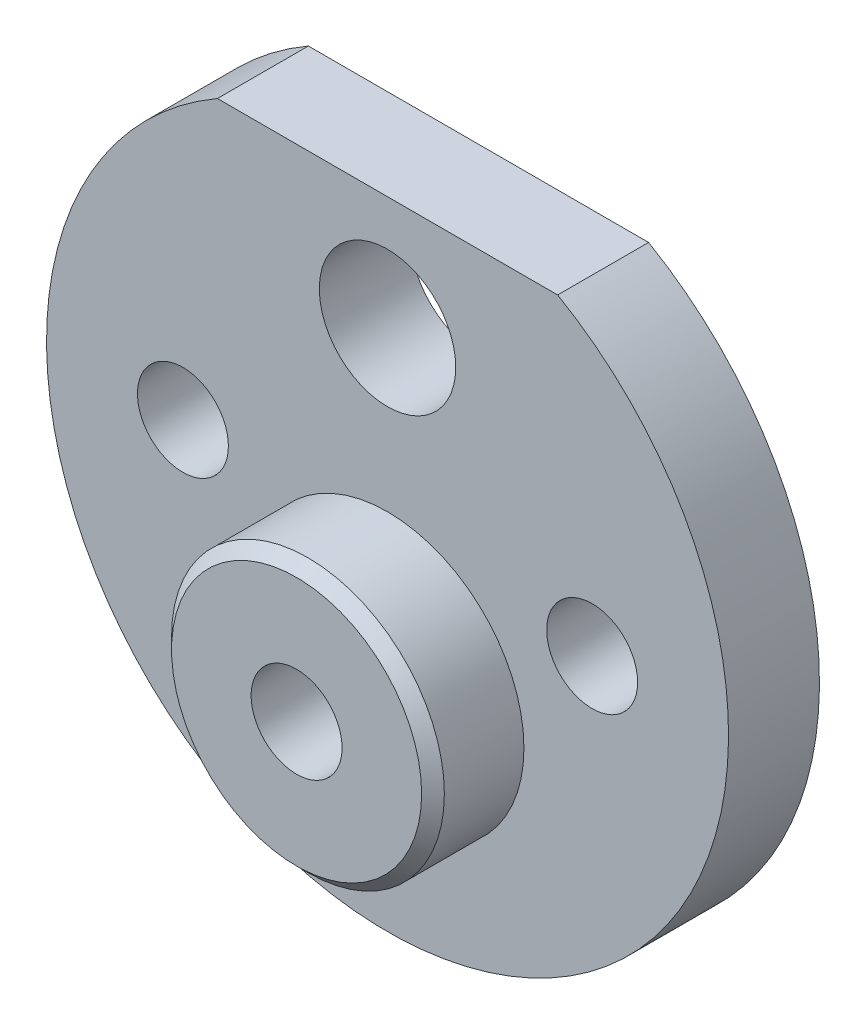
ISO-10303-21;
HEADER;
FILE_DESCRIPTION(('STEP AP214'),'2;1');
FILE_NAME('part.step','',(''),(''),'','','');
FILE_SCHEMA(('AUTOMOTIVE_DESIGN { 1 0 10303 214 1 1 1 1 }'));
ENDSEC;
DATA;
#1=APPLICATION_CONTEXT('core data for automotive mechanical design processes');
#2=APPLICATION_PROTOCOL_DEFINITION('international standard','automotive_design',2000,#1);
#3=PRODUCT_CONTEXT('',#1,'mechanical');
#4=PRODUCT('Part','Part','',(#3));
#5=PRODUCT_RELATED_PRODUCT_CATEGORY('part','',(#4));
#6=PRODUCT_DEFINITION_FORMATION('','',#4);
#7=PRODUCT_DEFINITION_CONTEXT('part definition',#1,'design');
#8=PRODUCT_DEFINITION('design','',#6,#7);
#9=PRODUCT_DEFINITION_SHAPE('','',#8);
#10=(LENGTH_UNIT() NAMED_UNIT(*) SI_UNIT(.MILLI.,.METRE.));
#11=(NAMED_UNIT(*) PLANE_ANGLE_UNIT() SI_UNIT($,.RADIAN.));
#12=(NAMED_UNIT(*) SI_UNIT($,.STERADIAN.) SOLID_ANGLE_UNIT());
#13=UNCERTAINTY_MEASURE_WITH_UNIT(LENGTH_MEASURE(1.E-05),#10,'distance_accuracy_value','');
#14=(GEOMETRIC_REPRESENTATION_CONTEXT(3) GLOBAL_UNCERTAINTY_ASSIGNED_CONTEXT((#13)) GLOBAL_UNIT_ASSIGNED_CONTEXT((#10,
#11,#12)) REPRESENTATION_CONTEXT('',''));
#15=CARTESIAN_POINT('',(0.,0.,0.));
#16=DIRECTION('',(0.,0.,1.));
#17=DIRECTION('',(1.,0.,0.));
#18=AXIS2_PLACEMENT_3D('',#15,#16,#17);
#19=CARTESIAN_POINT('',(0.,0.,4.));
#20=DIRECTION('',(0.,0.,1.));
#21=DIRECTION('',(1.,0.,0.));
#22=AXIS2_PLACEMENT_3D('',#19,#20,#21);
#23=PLANE('',#22);
#24=CARTESIAN_POINT('',(0.,-5.,4.));
#25=DIRECTION('',(0.,0.,1.));
#26=DIRECTION('',(1.,0.,0.));
#27=AXIS2_PLACEMENT_3D('',#24,#25,#26);
#28=CIRCLE('',#27,6.);
#29=CARTESIAN_POINT('',(6.,-5.,4.));
#30=VERTEX_POINT('',#29);
#31=EDGE_CURVE('E206',#30,#30,#28,.T.);
#32=ORIENTED_EDGE('',*,*,#31,.F.);
#33=EDGE_LOOP('',(#32));
#34=FACE_BOUND('',#33,.T.);
#35=CARTESIAN_POINT('',(-9.,0.,4.));
#36=DIRECTION('',(0.,0.,1.));
#37=DIRECTION('',(1.,0.,0.));
#38=AXIS2_PLACEMENT_3D('',#35,#36,#37);
#39=CIRCLE('',#38,2.);
#40=CARTESIAN_POINT('',(-7.,0.,4.));
#41=VERTEX_POINT('',#40);
#42=EDGE_CURVE('E225',#41,#41,#39,.T.);
#43=ORIENTED_EDGE('',*,*,#42,.F.);
#44=EDGE_LOOP('',(#43));
#45=FACE_BOUND('',#44,.T.);
#46=CARTESIAN_POINT('',(0.,0.,4.));
#47=DIRECTION('',(0.,0.,1.));
#48=DIRECTION('',(1.,0.,0.));
#49=AXIS2_PLACEMENT_3D('',#46,#47,#48);
#50=CIRCLE('',#49,15.);
#51=CARTESIAN_POINT('',(-7.48331477354788,13.,4.));
#52=VERTEX_POINT('',#51);
#53=CARTESIAN_POINT('',(7.48331477354788,13.,4.));
#54=VERTEX_POINT('',#53);
#55=EDGE_CURVE('E75',#52,#54,#50,.T.);
#56=ORIENTED_EDGE('',*,*,#55,.T.);
#57=DIRECTION('',(-1.,0.,0.));
#58=VECTOR('',#57,1.);
#59=CARTESIAN_POINT('',(-7.48331477354788,13.,4.));
#60=LINE('',#59,#58);
#61=EDGE_CURVE('E56',#54,#52,#60,.T.);
#62=ORIENTED_EDGE('',*,*,#61,.T.);
#63=EDGE_LOOP('',(#56,#62));
#64=FACE_BOUND('',#63,.T.);
#65=CARTESIAN_POINT('',(0.,8.,4.));
#66=DIRECTION('',(0.,0.,1.));
#67=DIRECTION('',(1.,0.,0.));
#68=AXIS2_PLACEMENT_3D('',#65,#66,#67);
#69=CIRCLE('',#68,3.);
#70=CARTESIAN_POINT('',(3.,8.,4.));
#71=VERTEX_POINT('',#70);
#72=EDGE_CURVE('E85',#71,#71,#69,.T.);
#73=ORIENTED_EDGE('',*,*,#72,.F.);
#74=EDGE_LOOP('',(#73));
#75=FACE_BOUND('',#74,.T.);
#76=CARTESIAN_POINT('',(9.,0.,4.));
#77=DIRECTION('',(0.,0.,1.));
#78=DIRECTION('',(1.,0.,0.));
#79=AXIS2_PLACEMENT_3D('',#76,#77,#78);
#80=CIRCLE('',#79,2.);
#81=CARTESIAN_POINT('',(11.,0.,4.));
#82=VERTEX_POINT('',#81);
#83=EDGE_CURVE('E214',#82,#82,#80,.T.);
#84=ORIENTED_EDGE('',*,*,#83,.F.);
#85=EDGE_LOOP('',(#84));
#86=FACE_BOUND('',#85,.T.);
#87=ADVANCED_FACE('F39',(#34,#45,#64,#75,#86),#23,.T.);
#88=CARTESIAN_POINT('',(0.,0.,0.));
#89=DIRECTION('',(0.,0.,1.));
#90=DIRECTION('',(1.,0.,0.));
#91=AXIS2_PLACEMENT_3D('',#88,#89,#90);
#92=PLANE('',#91);
#93=CARTESIAN_POINT('',(0.,-5.,0.));
#94=DIRECTION('',(0.,0.,1.));
#95=DIRECTION('',(1.,0.,0.));
#96=AXIS2_PLACEMENT_3D('',#93,#94,#95);
#97=CIRCLE('',#96,2.);
#98=CARTESIAN_POINT('',(2.,-5.,0.));
#99=VERTEX_POINT('',#98);
#100=EDGE_CURVE('E209',#99,#99,#97,.T.);
#101=ORIENTED_EDGE('',*,*,#100,.T.);
#102=EDGE_LOOP('',(#101));
#103=FACE_BOUND('',#102,.T.);
#104=CARTESIAN_POINT('',(0.,0.,0.));
#105=DIRECTION('',(0.,0.,1.));
#106=DIRECTION('',(1.,0.,0.));
#107=AXIS2_PLACEMENT_3D('',#104,#105,#106);
#108=CIRCLE('',#107,15.);
#109=CARTESIAN_POINT('',(-7.48331477354788,13.,0.));
#110=VERTEX_POINT('',#109);
#111=CARTESIAN_POINT('',(7.48331477354788,13.,0.));
#112=VERTEX_POINT('',#111);
#113=EDGE_CURVE('E76',#110,#112,#108,.T.);
#114=ORIENTED_EDGE('',*,*,#113,.F.);
#115=DIRECTION('',(-1.,0.,0.));
#116=VECTOR('',#115,1.);
#117=CARTESIAN_POINT('',(-7.48331477354788,13.,0.));
#118=LINE('',#117,#116);
#119=EDGE_CURVE('E64',#112,#110,#118,.T.);
#120=ORIENTED_EDGE('',*,*,#119,.F.);
#121=EDGE_LOOP('',(#114,#120));
#122=FACE_BOUND('',#121,.T.);
#123=CARTESIAN_POINT('',(0.,8.,0.));
#124=DIRECTION('',(0.,0.,1.));
#125=DIRECTION('',(1.,0.,0.));
#126=AXIS2_PLACEMENT_3D('',#123,#124,#125);
#127=CIRCLE('',#126,3.);
#128=CARTESIAN_POINT('',(3.,8.,0.));
#129=VERTEX_POINT('',#128);
#130=EDGE_CURVE('E89',#129,#129,#127,.T.);
#131=ORIENTED_EDGE('',*,*,#130,.T.);
#132=EDGE_LOOP('',(#131));
#133=FACE_BOUND('',#132,.T.);
#134=CARTESIAN_POINT('',(-9.,0.,0.));
#135=DIRECTION('',(0.,0.,1.));
#136=DIRECTION('',(1.,0.,0.));
#137=AXIS2_PLACEMENT_3D('',#134,#135,#136);
#138=CIRCLE('',#137,2.);
#139=CARTESIAN_POINT('',(-7.,0.,0.));
#140=VERTEX_POINT('',#139);
#141=EDGE_CURVE('E223',#140,#140,#138,.T.);
#142=ORIENTED_EDGE('',*,*,#141,.T.);
#143=EDGE_LOOP('',(#142));
#144=FACE_BOUND('',#143,.T.);
#145=CARTESIAN_POINT('',(9.,0.,0.));
#146=DIRECTION('',(0.,0.,1.));
#147=DIRECTION('',(1.,0.,0.));
#148=AXIS2_PLACEMENT_3D('',#145,#146,#147);
#149=CIRCLE('',#148,2.);
#150=CARTESIAN_POINT('',(11.,0.,0.));
#151=VERTEX_POINT('',#150);
#152=EDGE_CURVE('E208',#151,#151,#149,.T.);
#153=ORIENTED_EDGE('',*,*,#152,.T.);
#154=EDGE_LOOP('',(#153));
#155=FACE_BOUND('',#154,.T.);
#156=ADVANCED_FACE('F82',(#103,#122,#133,#144,#155),#92,.F.);
#157=CARTESIAN_POINT('',(0.,0.,4.));
#158=DIRECTION('',(0.,0.,-1.));
#159=DIRECTION('',(-1.,0.,0.));
#160=AXIS2_PLACEMENT_3D('',#157,#158,#159);
#161=CYLINDRICAL_SURFACE('',#160,15.);
#162=ORIENTED_EDGE('',*,*,#113,.T.);
#163=DIRECTION('',(0.,0.,-1.));
#164=VECTOR('',#163,1.);
#165=CARTESIAN_POINT('',(7.48331477354788,13.,4.));
#166=LINE('',#165,#164);
#167=EDGE_CURVE('E72',#54,#112,#166,.T.);
#168=ORIENTED_EDGE('',*,*,#167,.F.);
#169=ORIENTED_EDGE('',*,*,#55,.F.);
#170=DIRECTION('',(0.,0.,-1.));
#171=VECTOR('',#170,1.);
#172=CARTESIAN_POINT('',(-7.48331477354788,13.,4.));
#173=LINE('',#172,#171);
#174=EDGE_CURVE('E69',#52,#110,#173,.T.);
#175=ORIENTED_EDGE('',*,*,#174,.T.);
#176=EDGE_LOOP('',(#162,#168,#169,#175));
#177=FACE_BOUND('',#176,.T.);
#178=ADVANCED_FACE('F79',(#177),#161,.T.);
#179=CARTESIAN_POINT('',(-7.48331477354788,13.,4.));
#180=DIRECTION('',(0.,-1.,0.));
#181=DIRECTION('',(0.,0.,-1.));
#182=AXIS2_PLACEMENT_3D('',#179,#180,#181);
#183=PLANE('',#182);
#184=ORIENTED_EDGE('',*,*,#119,.T.);
#185=ORIENTED_EDGE('',*,*,#174,.F.);
#186=ORIENTED_EDGE('',*,*,#61,.F.);
#187=ORIENTED_EDGE('',*,*,#167,.T.);
#188=EDGE_LOOP('',(#184,#185,#186,#187));
#189=FACE_BOUND('',#188,.T.);
#190=ADVANCED_FACE('F68',(#189),#183,.F.);
#191=CARTESIAN_POINT('',(0.,8.,4.));
#192=DIRECTION('',(0.,0.,-1.));
#193=DIRECTION('',(-1.,0.,0.));
#194=AXIS2_PLACEMENT_3D('',#191,#192,#193);
#195=CYLINDRICAL_SURFACE('',#194,3.);
#196=ORIENTED_EDGE('',*,*,#72,.T.);
#197=EDGE_LOOP('',(#196));
#198=FACE_BOUND('',#197,.T.);
#199=ORIENTED_EDGE('',*,*,#130,.F.);
#200=EDGE_LOOP('',(#199));
#201=FACE_BOUND('',#200,.T.);
#202=ADVANCED_FACE('F122',(#198,#201),#195,.F.);
#203=CARTESIAN_POINT('',(-9.,0.,4.));
#204=DIRECTION('',(0.,0.,-1.));
#205=DIRECTION('',(-1.,0.,0.));
#206=AXIS2_PLACEMENT_3D('',#203,#204,#205);
#207=CYLINDRICAL_SURFACE('',#206,2.);
#208=ORIENTED_EDGE('',*,*,#42,.T.);
#209=EDGE_LOOP('',(#208));
#210=FACE_BOUND('',#209,.T.);
#211=ORIENTED_EDGE('',*,*,#141,.F.);
#212=EDGE_LOOP('',(#211));
#213=FACE_BOUND('',#212,.T.);
#214=ADVANCED_FACE('F141',(#210,#213),#207,.F.);
#215=CARTESIAN_POINT('',(9.,0.,4.));
#216=DIRECTION('',(0.,0.,-1.));
#217=DIRECTION('',(-1.,0.,0.));
#218=AXIS2_PLACEMENT_3D('',#215,#216,#217);
#219=CYLINDRICAL_SURFACE('',#218,2.);
#220=ORIENTED_EDGE('',*,*,#83,.T.);
#221=EDGE_LOOP('',(#220));
#222=FACE_BOUND('',#221,.T.);
#223=ORIENTED_EDGE('',*,*,#152,.F.);
#224=EDGE_LOOP('',(#223));
#225=FACE_BOUND('',#224,.T.);
#226=ADVANCED_FACE('F148',(#222,#225),#219,.F.);
#227=CARTESIAN_POINT('',(0.,-5.,8.));
#228=DIRECTION('',(0.,0.,-1.));
#229=DIRECTION('',(-1.,0.,0.));
#230=AXIS2_PLACEMENT_3D('',#227,#228,#229);
#231=CYLINDRICAL_SURFACE('',#230,6.);
#232=CARTESIAN_POINT('',(0.,-5.,7.5));
#233=DIRECTION('',(0.,0.,1.));
#234=DIRECTION('',(1.,0.,0.));
#235=AXIS2_PLACEMENT_3D('',#232,#233,#234);
#236=CIRCLE('',#235,6.);
#237=CARTESIAN_POINT('',(6.,-5.,7.5));
#238=VERTEX_POINT('',#237);
#239=EDGE_CURVE('E11',#238,#238,#236,.F.);
#240=ORIENTED_EDGE('',*,*,#239,.T.);
#241=EDGE_LOOP('',(#240));
#242=FACE_BOUND('',#241,.T.);
#243=ORIENTED_EDGE('',*,*,#31,.T.);
#244=EDGE_LOOP('',(#243));
#245=FACE_BOUND('',#244,.T.);
#246=ADVANCED_FACE('F155',(#242,#245),#231,.T.);
#247=CARTESIAN_POINT('',(0.,-5.,8.));
#248=DIRECTION('',(0.,0.,1.));
#249=DIRECTION('',(1.,0.,0.));
#250=AXIS2_PLACEMENT_3D('',#247,#248,#249);
#251=PLANE('',#250);
#252=CARTESIAN_POINT('',(0.,-5.,8.));
#253=DIRECTION('',(0.,0.,1.));
#254=DIRECTION('',(1.,0.,0.));
#255=AXIS2_PLACEMENT_3D('',#252,#253,#254);
#256=CIRCLE('',#255,5.50000000000001);
#257=CARTESIAN_POINT('',(5.50000000000001,-5.,8.));
#258=VERTEX_POINT('',#257);
#259=EDGE_CURVE('E49',#258,#258,#256,.T.);
#260=ORIENTED_EDGE('',*,*,#259,.T.);
#261=EDGE_LOOP('',(#260));
#262=FACE_BOUND('',#261,.T.);
#263=CARTESIAN_POINT('',(0.,-5.,8.));
#264=DIRECTION('',(0.,0.,1.));
#265=DIRECTION('',(1.,0.,0.));
#266=AXIS2_PLACEMENT_3D('',#263,#264,#265);
#267=CIRCLE('',#266,2.);
#268=CARTESIAN_POINT('',(2.,-5.,8.));
#269=VERTEX_POINT('',#268);
#270=EDGE_CURVE('E217',#269,#269,#267,.T.);
#271=ORIENTED_EDGE('',*,*,#270,.F.);
#272=EDGE_LOOP('',(#271));
#273=FACE_BOUND('',#272,.T.);
#274=ADVANCED_FACE('F99',(#262,#273),#251,.T.);
#275=CARTESIAN_POINT('',(0.,-5.,0.));
#276=DIRECTION('',(0.,0.,1.));
#277=DIRECTION('',(1.,0.,0.));
#278=AXIS2_PLACEMENT_3D('',#275,#276,#277);
#279=CYLINDRICAL_SURFACE('',#278,2.);
#280=ORIENTED_EDGE('',*,*,#100,.F.);
#281=EDGE_LOOP('',(#280));
#282=FACE_BOUND('',#281,.T.);
#283=ORIENTED_EDGE('',*,*,#270,.T.);
#284=EDGE_LOOP('',(#283));
#285=FACE_BOUND('',#284,.T.);
#286=ADVANCED_FACE('F103',(#282,#285),#279,.F.);
#287=CARTESIAN_POINT('',(0.,-5.,8.));
#288=DIRECTION('',(0.,0.,-1.));
#289=DIRECTION('',(-1.,0.,0.));
#290=AXIS2_PLACEMENT_3D('',#287,#288,#289);
#291=CONICAL_SURFACE('',#290,5.50000000000001,0.785398163397447);
#292=ORIENTED_EDGE('',*,*,#239,.F.);
#293=EDGE_LOOP('',(#292));
#294=FACE_BOUND('',#293,.T.);
#295=ORIENTED_EDGE('',*,*,#259,.F.);
#296=EDGE_LOOP('',(#295));
#297=FACE_BOUND('',#296,.T.);
#298=ADVANCED_FACE('F41',(#294,#297),#291,.T.);
#299=CLOSED_SHELL('',(#87,#156,#178,#190,#202,#214,#226,#246,#274,#286,#298));
#300=MANIFOLD_SOLID_BREP('B2',#299);
#301=ADVANCED_BREP_SHAPE_REPRESENTATION('',(#18,#300),#14);
#302=SHAPE_DEFINITION_REPRESENTATION(#9,#301);
ENDSEC;
END-ISO-10303-21;
